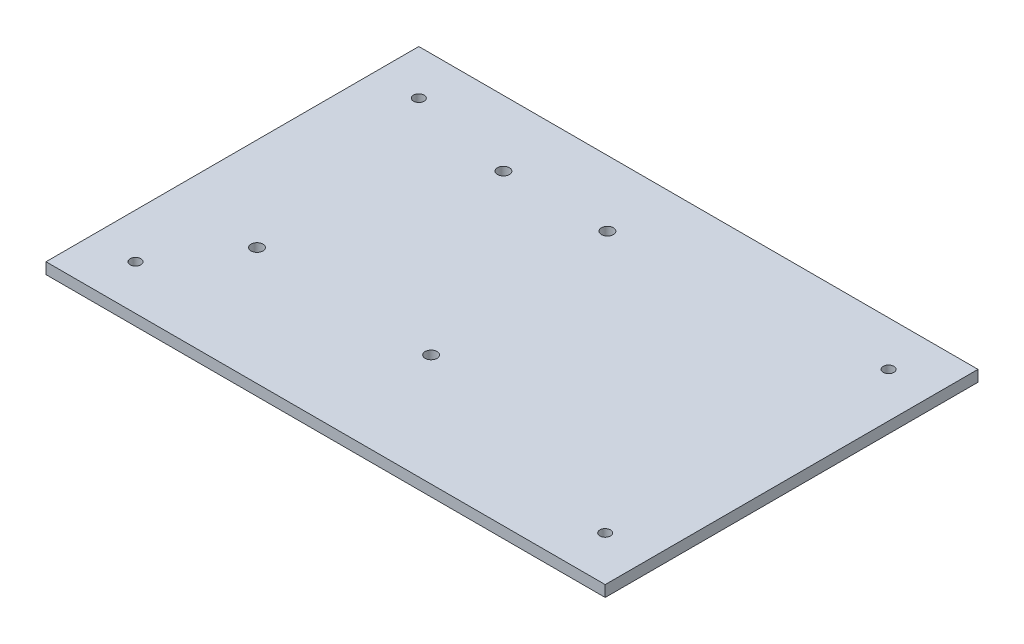
ISO-10303-21;
HEADER;
FILE_DESCRIPTION(('STEP AP214'),'2;1');
FILE_NAME('part.step','',(''),(''),'','','');
FILE_SCHEMA(('AUTOMOTIVE_DESIGN { 1 0 10303 214 1 1 1 1 }'));
ENDSEC;
DATA;
#1=APPLICATION_CONTEXT('core data for automotive mechanical design processes');
#2=APPLICATION_PROTOCOL_DEFINITION('international standard','automotive_design',2000,#1);
#3=PRODUCT_CONTEXT('',#1,'mechanical');
#4=PRODUCT('Part','Part','',(#3));
#5=PRODUCT_RELATED_PRODUCT_CATEGORY('part','',(#4));
#6=PRODUCT_DEFINITION_FORMATION('','',#4);
#7=PRODUCT_DEFINITION_CONTEXT('part definition',#1,'design');
#8=PRODUCT_DEFINITION('design','',#6,#7);
#9=PRODUCT_DEFINITION_SHAPE('','',#8);
#10=(LENGTH_UNIT() NAMED_UNIT(*) SI_UNIT(.MILLI.,.METRE.));
#11=(NAMED_UNIT(*) PLANE_ANGLE_UNIT() SI_UNIT($,.RADIAN.));
#12=(NAMED_UNIT(*) SI_UNIT($,.STERADIAN.) SOLID_ANGLE_UNIT());
#13=UNCERTAINTY_MEASURE_WITH_UNIT(LENGTH_MEASURE(1.E-05),#10,'distance_accuracy_value','');
#14=(GEOMETRIC_REPRESENTATION_CONTEXT(3) GLOBAL_UNCERTAINTY_ASSIGNED_CONTEXT((#13)) GLOBAL_UNIT_ASSIGNED_CONTEXT((#10,
#11,#12)) REPRESENTATION_CONTEXT('',''));
#15=CARTESIAN_POINT('',(0.,0.,0.));
#16=DIRECTION('',(0.,0.,1.));
#17=DIRECTION('',(1.,0.,0.));
#18=AXIS2_PLACEMENT_3D('',#15,#16,#17);
#19=CARTESIAN_POINT('',(-75.,3.,50.));
#20=DIRECTION('',(1.,0.,0.));
#21=DIRECTION('',(0.,0.,-1.));
#22=AXIS2_PLACEMENT_3D('',#19,#20,#21);
#23=PLANE('',#22);
#24=DIRECTION('',(0.,0.,1.));
#25=VECTOR('',#24,1.);
#26=CARTESIAN_POINT('',(-75.,0.,50.));
#27=LINE('',#26,#25);
#28=CARTESIAN_POINT('',(-75.,0.,-50.));
#29=VERTEX_POINT('',#28);
#30=CARTESIAN_POINT('',(-75.,0.,50.));
#31=VERTEX_POINT('',#30);
#32=EDGE_CURVE('E98',#29,#31,#27,.T.);
#33=ORIENTED_EDGE('',*,*,#32,.T.);
#34=DIRECTION('',(0.,-1.,0.));
#35=VECTOR('',#34,1.);
#36=CARTESIAN_POINT('',(-75.,3.,50.));
#37=LINE('',#36,#35);
#38=CARTESIAN_POINT('',(-75.,3.,50.));
#39=VERTEX_POINT('',#38);
#40=EDGE_CURVE('E11',#39,#31,#37,.T.);
#41=ORIENTED_EDGE('',*,*,#40,.F.);
#42=DIRECTION('',(0.,0.,1.));
#43=VECTOR('',#42,1.);
#44=CARTESIAN_POINT('',(-75.,3.,50.));
#45=LINE('',#44,#43);
#46=CARTESIAN_POINT('',(-75.,3.,-50.));
#47=VERTEX_POINT('',#46);
#48=EDGE_CURVE('E85',#47,#39,#45,.T.);
#49=ORIENTED_EDGE('',*,*,#48,.F.);
#50=DIRECTION('',(0.,-1.,0.));
#51=VECTOR('',#50,1.);
#52=CARTESIAN_POINT('',(-75.,3.,-50.));
#53=LINE('',#52,#51);
#54=EDGE_CURVE('E94',#47,#29,#53,.T.);
#55=ORIENTED_EDGE('',*,*,#54,.T.);
#56=EDGE_LOOP('',(#33,#41,#49,#55));
#57=FACE_BOUND('',#56,.T.);
#58=ADVANCED_FACE('F32',(#57),#23,.F.);
#59=CARTESIAN_POINT('',(75.,3.,50.));
#60=DIRECTION('',(0.,0.,-1.));
#61=DIRECTION('',(-1.,0.,0.));
#62=AXIS2_PLACEMENT_3D('',#59,#60,#61);
#63=PLANE('',#62);
#64=DIRECTION('',(1.,0.,0.));
#65=VECTOR('',#64,1.);
#66=CARTESIAN_POINT('',(75.,0.,50.));
#67=LINE('',#66,#65);
#68=CARTESIAN_POINT('',(75.,0.,50.));
#69=VERTEX_POINT('',#68);
#70=EDGE_CURVE('E89',#31,#69,#67,.T.);
#71=ORIENTED_EDGE('',*,*,#70,.T.);
#72=DIRECTION('',(0.,-1.,0.));
#73=VECTOR('',#72,1.);
#74=CARTESIAN_POINT('',(75.,3.,50.));
#75=LINE('',#74,#73);
#76=CARTESIAN_POINT('',(75.,3.,50.));
#77=VERTEX_POINT('',#76);
#78=EDGE_CURVE('E41',#77,#69,#75,.T.);
#79=ORIENTED_EDGE('',*,*,#78,.F.);
#80=DIRECTION('',(1.,0.,0.));
#81=VECTOR('',#80,1.);
#82=CARTESIAN_POINT('',(75.,3.,50.));
#83=LINE('',#82,#81);
#84=EDGE_CURVE('E80',#39,#77,#83,.T.);
#85=ORIENTED_EDGE('',*,*,#84,.F.);
#86=ORIENTED_EDGE('',*,*,#40,.T.);
#87=EDGE_LOOP('',(#71,#79,#85,#86));
#88=FACE_BOUND('',#87,.T.);
#89=ADVANCED_FACE('F88',(#88),#63,.F.);
#90=CARTESIAN_POINT('',(75.,3.,50.));
#91=DIRECTION('',(-1.,0.,0.));
#92=DIRECTION('',(0.,0.,1.));
#93=AXIS2_PLACEMENT_3D('',#90,#91,#92);
#94=PLANE('',#93);
#95=DIRECTION('',(0.,0.,-1.));
#96=VECTOR('',#95,1.);
#97=CARTESIAN_POINT('',(75.,0.,50.));
#98=LINE('',#97,#96);
#99=CARTESIAN_POINT('',(75.,0.,-50.));
#100=VERTEX_POINT('',#99);
#101=EDGE_CURVE('E67',#69,#100,#98,.T.);
#102=ORIENTED_EDGE('',*,*,#101,.T.);
#103=DIRECTION('',(0.,-1.,0.));
#104=VECTOR('',#103,1.);
#105=CARTESIAN_POINT('',(75.,3.,-50.));
#106=LINE('',#105,#104);
#107=CARTESIAN_POINT('',(75.,3.,-50.));
#108=VERTEX_POINT('',#107);
#109=EDGE_CURVE('E90',#108,#100,#106,.T.);
#110=ORIENTED_EDGE('',*,*,#109,.F.);
#111=DIRECTION('',(0.,0.,-1.));
#112=VECTOR('',#111,1.);
#113=CARTESIAN_POINT('',(75.,3.,50.));
#114=LINE('',#113,#112);
#115=EDGE_CURVE('E83',#77,#108,#114,.T.);
#116=ORIENTED_EDGE('',*,*,#115,.F.);
#117=ORIENTED_EDGE('',*,*,#78,.T.);
#118=EDGE_LOOP('',(#102,#110,#116,#117));
#119=FACE_BOUND('',#118,.T.);
#120=ADVANCED_FACE('F92',(#119),#94,.F.);
#121=CARTESIAN_POINT('',(75.,3.,-50.));
#122=DIRECTION('',(0.,0.,1.));
#123=DIRECTION('',(1.,0.,0.));
#124=AXIS2_PLACEMENT_3D('',#121,#122,#123);
#125=PLANE('',#124);
#126=DIRECTION('',(-1.,0.,0.));
#127=VECTOR('',#126,1.);
#128=CARTESIAN_POINT('',(75.,0.,-50.));
#129=LINE('',#128,#127);
#130=EDGE_CURVE('E73',#100,#29,#129,.T.);
#131=ORIENTED_EDGE('',*,*,#130,.T.);
#132=ORIENTED_EDGE('',*,*,#54,.F.);
#133=DIRECTION('',(-1.,0.,0.));
#134=VECTOR('',#133,1.);
#135=CARTESIAN_POINT('',(75.,3.,-50.));
#136=LINE('',#135,#134);
#137=EDGE_CURVE('E50',#108,#47,#136,.T.);
#138=ORIENTED_EDGE('',*,*,#137,.F.);
#139=ORIENTED_EDGE('',*,*,#109,.T.);
#140=EDGE_LOOP('',(#131,#132,#138,#139));
#141=FACE_BOUND('',#140,.T.);
#142=ADVANCED_FACE('F142',(#141),#125,.F.);
#143=CARTESIAN_POINT('',(0.,3.,0.));
#144=DIRECTION('',(0.,1.,0.));
#145=DIRECTION('',(0.,0.,1.));
#146=AXIS2_PLACEMENT_3D('',#143,#144,#145);
#147=PLANE('',#146);
#148=CARTESIAN_POINT('',(63.,3.,38.));
#149=DIRECTION('',(0.,1.,0.));
#150=DIRECTION('',(0.,0.,1.));
#151=AXIS2_PLACEMENT_3D('',#148,#149,#150);
#152=CIRCLE('',#151,1.425);
#153=CARTESIAN_POINT('',(63.,3.,39.425));
#154=VERTEX_POINT('',#153);
#155=EDGE_CURVE('E264',#154,#154,#152,.T.);
#156=ORIENTED_EDGE('',*,*,#155,.F.);
#157=EDGE_LOOP('',(#156));
#158=FACE_BOUND('',#157,.T.);
#159=CARTESIAN_POINT('',(63.,3.,-38.));
#160=DIRECTION('',(0.,1.,0.));
#161=DIRECTION('',(0.,0.,1.));
#162=AXIS2_PLACEMENT_3D('',#159,#160,#161);
#163=CIRCLE('',#162,1.425);
#164=CARTESIAN_POINT('',(63.,3.,-36.575));
#165=VERTEX_POINT('',#164);
#166=EDGE_CURVE('E268',#165,#165,#163,.T.);
#167=ORIENTED_EDGE('',*,*,#166,.F.);
#168=EDGE_LOOP('',(#167));
#169=FACE_BOUND('',#168,.T.);
#170=CARTESIAN_POINT('',(-50.,3.,18.4));
#171=DIRECTION('',(0.,1.,0.));
#172=DIRECTION('',(0.,0.,1.));
#173=AXIS2_PLACEMENT_3D('',#170,#171,#172);
#174=CIRCLE('',#173,1.6);
#175=CARTESIAN_POINT('',(-50.,3.,20.));
#176=VERTEX_POINT('',#175);
#177=EDGE_CURVE('E277',#176,#176,#174,.T.);
#178=ORIENTED_EDGE('',*,*,#177,.F.);
#179=EDGE_LOOP('',(#178));
#180=FACE_BOUND('',#179,.T.);
#181=CARTESIAN_POINT('',(-1.7,3.,20.));
#182=DIRECTION('',(0.,1.,0.));
#183=DIRECTION('',(0.,0.,1.));
#184=AXIS2_PLACEMENT_3D('',#181,#182,#183);
#185=CIRCLE('',#184,1.6);
#186=CARTESIAN_POINT('',(-1.7,3.,21.6));
#187=VERTEX_POINT('',#186);
#188=EDGE_CURVE('E281',#187,#187,#185,.T.);
#189=ORIENTED_EDGE('',*,*,#188,.F.);
#190=EDGE_LOOP('',(#189));
#191=FACE_BOUND('',#190,.T.);
#192=CARTESIAN_POINT('',(-6.8,3.,-32.4));
#193=DIRECTION('',(0.,1.,0.));
#194=DIRECTION('',(0.,0.,1.));
#195=AXIS2_PLACEMENT_3D('',#192,#193,#194);
#196=CIRCLE('',#195,1.6);
#197=CARTESIAN_POINT('',(-6.8,3.,-30.8));
#198=VERTEX_POINT('',#197);
#199=EDGE_CURVE('E278',#198,#198,#196,.T.);
#200=ORIENTED_EDGE('',*,*,#199,.F.);
#201=EDGE_LOOP('',(#200));
#202=FACE_BOUND('',#201,.T.);
#203=CARTESIAN_POINT('',(-34.7,3.,-32.4));
#204=DIRECTION('',(0.,1.,0.));
#205=DIRECTION('',(0.,0.,1.));
#206=AXIS2_PLACEMENT_3D('',#203,#204,#205);
#207=CIRCLE('',#206,1.6);
#208=CARTESIAN_POINT('',(-34.7,3.,-30.8));
#209=VERTEX_POINT('',#208);
#210=EDGE_CURVE('E118',#209,#209,#207,.T.);
#211=ORIENTED_EDGE('',*,*,#210,.F.);
#212=EDGE_LOOP('',(#211));
#213=FACE_BOUND('',#212,.T.);
#214=CARTESIAN_POINT('',(-63.,3.,38.));
#215=DIRECTION('',(0.,1.,0.));
#216=DIRECTION('',(0.,0.,1.));
#217=AXIS2_PLACEMENT_3D('',#214,#215,#216);
#218=CIRCLE('',#217,1.425);
#219=CARTESIAN_POINT('',(-63.,3.,39.425));
#220=VERTEX_POINT('',#219);
#221=EDGE_CURVE('E113',#220,#220,#218,.T.);
#222=ORIENTED_EDGE('',*,*,#221,.F.);
#223=EDGE_LOOP('',(#222));
#224=FACE_BOUND('',#223,.T.);
#225=CARTESIAN_POINT('',(-63.,3.,-38.));
#226=DIRECTION('',(0.,1.,0.));
#227=DIRECTION('',(0.,0.,1.));
#228=AXIS2_PLACEMENT_3D('',#225,#226,#227);
#229=CIRCLE('',#228,1.425);
#230=CARTESIAN_POINT('',(-63.,3.,-36.575));
#231=VERTEX_POINT('',#230);
#232=EDGE_CURVE('E109',#231,#231,#229,.T.);
#233=ORIENTED_EDGE('',*,*,#232,.F.);
#234=EDGE_LOOP('',(#233));
#235=FACE_BOUND('',#234,.T.);
#236=ORIENTED_EDGE('',*,*,#48,.T.);
#237=ORIENTED_EDGE('',*,*,#84,.T.);
#238=ORIENTED_EDGE('',*,*,#115,.T.);
#239=ORIENTED_EDGE('',*,*,#137,.T.);
#240=EDGE_LOOP('',(#236,#237,#238,#239));
#241=FACE_BOUND('',#240,.T.);
#242=ADVANCED_FACE('F81',(#158,#169,#180,#191,#202,#213,#224,#235,#241),#147,.T.);
#243=CARTESIAN_POINT('',(0.,0.,0.));
#244=DIRECTION('',(0.,1.,0.));
#245=DIRECTION('',(0.,0.,1.));
#246=AXIS2_PLACEMENT_3D('',#243,#244,#245);
#247=PLANE('',#246);
#248=CARTESIAN_POINT('',(63.,0.,38.));
#249=DIRECTION('',(0.,-1.,0.));
#250=DIRECTION('',(0.,0.,-1.));
#251=AXIS2_PLACEMENT_3D('',#248,#249,#250);
#252=CIRCLE('',#251,1.425);
#253=CARTESIAN_POINT('',(63.,0.,36.575));
#254=VERTEX_POINT('',#253);
#255=EDGE_CURVE('E267',#254,#254,#252,.T.);
#256=ORIENTED_EDGE('',*,*,#255,.F.);
#257=EDGE_LOOP('',(#256));
#258=FACE_BOUND('',#257,.T.);
#259=CARTESIAN_POINT('',(63.,0.,-38.));
#260=DIRECTION('',(0.,-1.,0.));
#261=DIRECTION('',(0.,0.,-1.));
#262=AXIS2_PLACEMENT_3D('',#259,#260,#261);
#263=CIRCLE('',#262,1.425);
#264=CARTESIAN_POINT('',(63.,0.,-39.425));
#265=VERTEX_POINT('',#264);
#266=EDGE_CURVE('E269',#265,#265,#263,.T.);
#267=ORIENTED_EDGE('',*,*,#266,.F.);
#268=EDGE_LOOP('',(#267));
#269=FACE_BOUND('',#268,.T.);
#270=CARTESIAN_POINT('',(-50.,0.,18.4));
#271=DIRECTION('',(0.,1.,0.));
#272=DIRECTION('',(0.,0.,1.));
#273=AXIS2_PLACEMENT_3D('',#270,#271,#272);
#274=CIRCLE('',#273,1.6);
#275=CARTESIAN_POINT('',(-50.,0.,20.));
#276=VERTEX_POINT('',#275);
#277=EDGE_CURVE('E35',#276,#276,#274,.T.);
#278=ORIENTED_EDGE('',*,*,#277,.T.);
#279=EDGE_LOOP('',(#278));
#280=FACE_BOUND('',#279,.T.);
#281=CARTESIAN_POINT('',(-1.7,0.,20.));
#282=DIRECTION('',(0.,1.,0.));
#283=DIRECTION('',(0.,0.,1.));
#284=AXIS2_PLACEMENT_3D('',#281,#282,#283);
#285=CIRCLE('',#284,1.6);
#286=CARTESIAN_POINT('',(-1.7,0.,21.6));
#287=VERTEX_POINT('',#286);
#288=EDGE_CURVE('E120',#287,#287,#285,.T.);
#289=ORIENTED_EDGE('',*,*,#288,.T.);
#290=EDGE_LOOP('',(#289));
#291=FACE_BOUND('',#290,.T.);
#292=CARTESIAN_POINT('',(-6.8,0.,-32.4));
#293=DIRECTION('',(0.,1.,0.));
#294=DIRECTION('',(0.,0.,1.));
#295=AXIS2_PLACEMENT_3D('',#292,#293,#294);
#296=CIRCLE('',#295,1.6);
#297=CARTESIAN_POINT('',(-6.8,0.,-30.8));
#298=VERTEX_POINT('',#297);
#299=EDGE_CURVE('E117',#298,#298,#296,.T.);
#300=ORIENTED_EDGE('',*,*,#299,.T.);
#301=EDGE_LOOP('',(#300));
#302=FACE_BOUND('',#301,.T.);
#303=CARTESIAN_POINT('',(-34.7,0.,-32.4));
#304=DIRECTION('',(0.,1.,0.));
#305=DIRECTION('',(0.,0.,1.));
#306=AXIS2_PLACEMENT_3D('',#303,#304,#305);
#307=CIRCLE('',#306,1.6);
#308=CARTESIAN_POINT('',(-34.7,0.,-30.8));
#309=VERTEX_POINT('',#308);
#310=EDGE_CURVE('E114',#309,#309,#307,.T.);
#311=ORIENTED_EDGE('',*,*,#310,.T.);
#312=EDGE_LOOP('',(#311));
#313=FACE_BOUND('',#312,.T.);
#314=CARTESIAN_POINT('',(-63.,0.,38.));
#315=DIRECTION('',(0.,1.,0.));
#316=DIRECTION('',(0.,0.,1.));
#317=AXIS2_PLACEMENT_3D('',#314,#315,#316);
#318=CIRCLE('',#317,1.425);
#319=CARTESIAN_POINT('',(-63.,0.,39.425));
#320=VERTEX_POINT('',#319);
#321=EDGE_CURVE('E110',#320,#320,#318,.T.);
#322=ORIENTED_EDGE('',*,*,#321,.T.);
#323=EDGE_LOOP('',(#322));
#324=FACE_BOUND('',#323,.T.);
#325=CARTESIAN_POINT('',(-63.,0.,-38.));
#326=DIRECTION('',(0.,1.,0.));
#327=DIRECTION('',(0.,0.,1.));
#328=AXIS2_PLACEMENT_3D('',#325,#326,#327);
#329=CIRCLE('',#328,1.425);
#330=CARTESIAN_POINT('',(-63.,0.,-36.575));
#331=VERTEX_POINT('',#330);
#332=EDGE_CURVE('E101',#331,#331,#329,.T.);
#333=ORIENTED_EDGE('',*,*,#332,.T.);
#334=EDGE_LOOP('',(#333));
#335=FACE_BOUND('',#334,.T.);
#336=ORIENTED_EDGE('',*,*,#32,.F.);
#337=ORIENTED_EDGE('',*,*,#130,.F.);
#338=ORIENTED_EDGE('',*,*,#101,.F.);
#339=ORIENTED_EDGE('',*,*,#70,.F.);
#340=EDGE_LOOP('',(#336,#337,#338,#339));
#341=FACE_BOUND('',#340,.T.);
#342=ADVANCED_FACE('F141',(#258,#269,#280,#291,#302,#313,#324,#335,#341),#247,.F.);
#343=CARTESIAN_POINT('',(-63.,-7.,-38.));
#344=DIRECTION('',(0.,1.,0.));
#345=DIRECTION('',(0.,0.,1.));
#346=AXIS2_PLACEMENT_3D('',#343,#344,#345);
#347=CYLINDRICAL_SURFACE('',#346,1.425);
#348=ORIENTED_EDGE('',*,*,#232,.T.);
#349=EDGE_LOOP('',(#348));
#350=FACE_BOUND('',#349,.T.);
#351=ORIENTED_EDGE('',*,*,#332,.F.);
#352=EDGE_LOOP('',(#351));
#353=FACE_BOUND('',#352,.T.);
#354=ADVANCED_FACE('F137',(#350,#353),#347,.F.);
#355=CARTESIAN_POINT('',(-63.,-7.,38.));
#356=DIRECTION('',(0.,1.,0.));
#357=DIRECTION('',(0.,0.,1.));
#358=AXIS2_PLACEMENT_3D('',#355,#356,#357);
#359=CYLINDRICAL_SURFACE('',#358,1.425);
#360=ORIENTED_EDGE('',*,*,#221,.T.);
#361=EDGE_LOOP('',(#360));
#362=FACE_BOUND('',#361,.T.);
#363=ORIENTED_EDGE('',*,*,#321,.F.);
#364=EDGE_LOOP('',(#363));
#365=FACE_BOUND('',#364,.T.);
#366=ADVANCED_FACE('F182',(#362,#365),#359,.F.);
#367=CARTESIAN_POINT('',(-34.7,-7.,-32.4));
#368=DIRECTION('',(0.,1.,0.));
#369=DIRECTION('',(0.,0.,1.));
#370=AXIS2_PLACEMENT_3D('',#367,#368,#369);
#371=CYLINDRICAL_SURFACE('',#370,1.6);
#372=ORIENTED_EDGE('',*,*,#210,.T.);
#373=EDGE_LOOP('',(#372));
#374=FACE_BOUND('',#373,.T.);
#375=ORIENTED_EDGE('',*,*,#310,.F.);
#376=EDGE_LOOP('',(#375));
#377=FACE_BOUND('',#376,.T.);
#378=ADVANCED_FACE('F191',(#374,#377),#371,.F.);
#379=CARTESIAN_POINT('',(-6.8,-7.,-32.4));
#380=DIRECTION('',(0.,1.,0.));
#381=DIRECTION('',(0.,0.,1.));
#382=AXIS2_PLACEMENT_3D('',#379,#380,#381);
#383=CYLINDRICAL_SURFACE('',#382,1.6);
#384=ORIENTED_EDGE('',*,*,#199,.T.);
#385=EDGE_LOOP('',(#384));
#386=FACE_BOUND('',#385,.T.);
#387=ORIENTED_EDGE('',*,*,#299,.F.);
#388=EDGE_LOOP('',(#387));
#389=FACE_BOUND('',#388,.T.);
#390=ADVANCED_FACE('F200',(#386,#389),#383,.F.);
#391=CARTESIAN_POINT('',(-1.7,-7.,20.));
#392=DIRECTION('',(0.,1.,0.));
#393=DIRECTION('',(0.,0.,1.));
#394=AXIS2_PLACEMENT_3D('',#391,#392,#393);
#395=CYLINDRICAL_SURFACE('',#394,1.6);
#396=ORIENTED_EDGE('',*,*,#188,.T.);
#397=EDGE_LOOP('',(#396));
#398=FACE_BOUND('',#397,.T.);
#399=ORIENTED_EDGE('',*,*,#288,.F.);
#400=EDGE_LOOP('',(#399));
#401=FACE_BOUND('',#400,.T.);
#402=ADVANCED_FACE('F210',(#398,#401),#395,.F.);
#403=CARTESIAN_POINT('',(-50.,-7.,18.4));
#404=DIRECTION('',(0.,1.,0.));
#405=DIRECTION('',(0.,0.,1.));
#406=AXIS2_PLACEMENT_3D('',#403,#404,#405);
#407=CYLINDRICAL_SURFACE('',#406,1.6);
#408=ORIENTED_EDGE('',*,*,#177,.T.);
#409=EDGE_LOOP('',(#408));
#410=FACE_BOUND('',#409,.T.);
#411=ORIENTED_EDGE('',*,*,#277,.F.);
#412=EDGE_LOOP('',(#411));
#413=FACE_BOUND('',#412,.T.);
#414=ADVANCED_FACE('F220',(#410,#413),#407,.F.);
#415=CARTESIAN_POINT('',(63.,10.,-38.));
#416=DIRECTION('',(0.,-1.,0.));
#417=DIRECTION('',(0.,0.,-1.));
#418=AXIS2_PLACEMENT_3D('',#415,#416,#417);
#419=CYLINDRICAL_SURFACE('',#418,1.425);
#420=ORIENTED_EDGE('',*,*,#166,.T.);
#421=EDGE_LOOP('',(#420));
#422=FACE_BOUND('',#421,.T.);
#423=ORIENTED_EDGE('',*,*,#266,.T.);
#424=EDGE_LOOP('',(#423));
#425=FACE_BOUND('',#424,.T.);
#426=ADVANCED_FACE('F229',(#422,#425),#419,.F.);
#427=CARTESIAN_POINT('',(63.,10.,38.));
#428=DIRECTION('',(0.,-1.,0.));
#429=DIRECTION('',(0.,0.,-1.));
#430=AXIS2_PLACEMENT_3D('',#427,#428,#429);
#431=CYLINDRICAL_SURFACE('',#430,1.425);
#432=ORIENTED_EDGE('',*,*,#155,.T.);
#433=EDGE_LOOP('',(#432));
#434=FACE_BOUND('',#433,.T.);
#435=ORIENTED_EDGE('',*,*,#255,.T.);
#436=EDGE_LOOP('',(#435));
#437=FACE_BOUND('',#436,.T.);
#438=ADVANCED_FACE('F248',(#434,#437),#431,.F.);
#439=CLOSED_SHELL('',(#58,#89,#120,#142,#242,#342,#354,#366,#378,#390,#402,#414,#426,#438));
#440=MANIFOLD_SOLID_BREP('B2',#439);
#441=ADVANCED_BREP_SHAPE_REPRESENTATION('',(#18,#440),#14);
#442=SHAPE_DEFINITION_REPRESENTATION(#9,#441);
ENDSEC;
END-ISO-10303-21;
